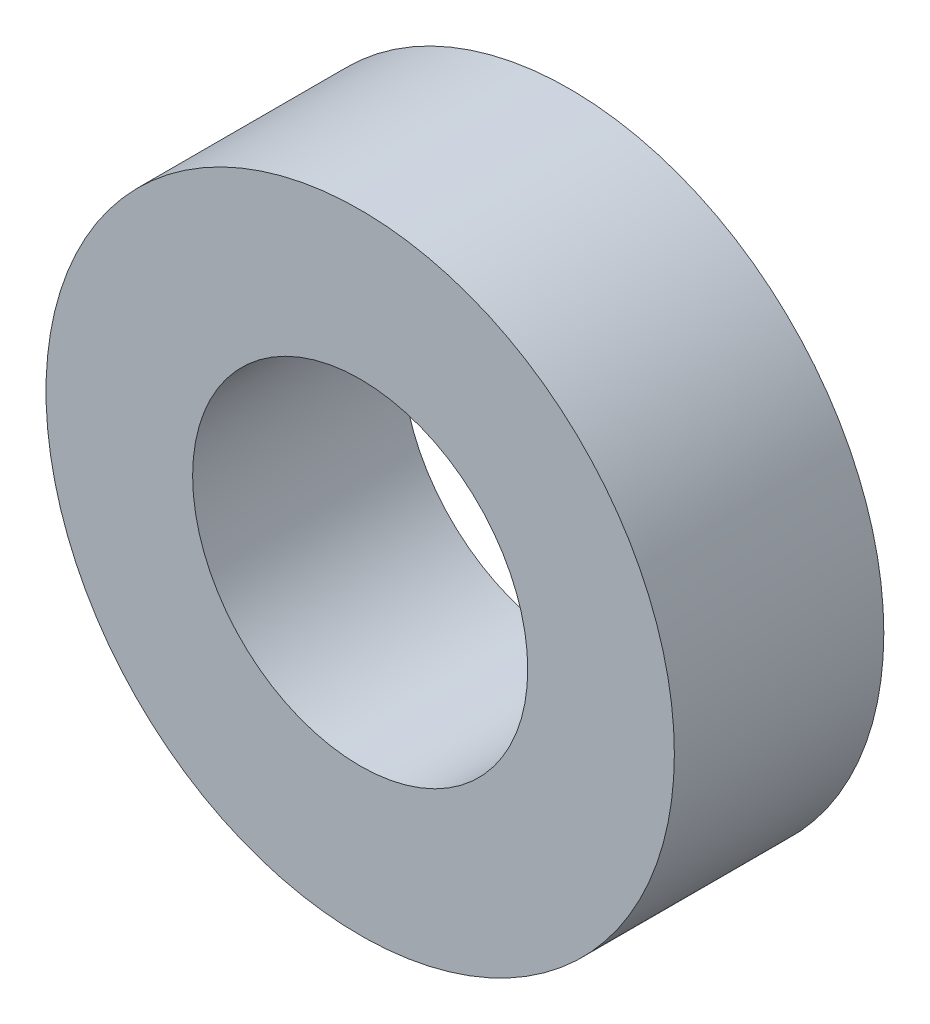
ISO-10303-21;
HEADER;
FILE_DESCRIPTION(('STEP AP214'),'2;1');
FILE_NAME('part.step','',(''),(''),'','','');
FILE_SCHEMA(('AUTOMOTIVE_DESIGN { 1 0 10303 214 1 1 1 1 }'));
ENDSEC;
DATA;
#1=APPLICATION_CONTEXT('core data for automotive mechanical design processes');
#2=APPLICATION_PROTOCOL_DEFINITION('international standard','automotive_design',2000,#1);
#3=PRODUCT_CONTEXT('',#1,'mechanical');
#4=PRODUCT('Part','Part','',(#3));
#5=PRODUCT_RELATED_PRODUCT_CATEGORY('part','',(#4));
#6=PRODUCT_DEFINITION_FORMATION('','',#4);
#7=PRODUCT_DEFINITION_CONTEXT('part definition',#1,'design');
#8=PRODUCT_DEFINITION('design','',#6,#7);
#9=PRODUCT_DEFINITION_SHAPE('','',#8);
#10=(LENGTH_UNIT() NAMED_UNIT(*) SI_UNIT(.MILLI.,.METRE.));
#11=(NAMED_UNIT(*) PLANE_ANGLE_UNIT() SI_UNIT($,.RADIAN.));
#12=(NAMED_UNIT(*) SI_UNIT($,.STERADIAN.) SOLID_ANGLE_UNIT());
#13=UNCERTAINTY_MEASURE_WITH_UNIT(LENGTH_MEASURE(1.E-05),#10,'distance_accuracy_value','');
#14=(GEOMETRIC_REPRESENTATION_CONTEXT(3) GLOBAL_UNCERTAINTY_ASSIGNED_CONTEXT((#13)) GLOBAL_UNIT_ASSIGNED_CONTEXT((#10,
#11,#12)) REPRESENTATION_CONTEXT('',''));
#15=CARTESIAN_POINT('',(0.,0.,0.));
#16=DIRECTION('',(0.,0.,1.));
#17=DIRECTION('',(1.,0.,0.));
#18=AXIS2_PLACEMENT_3D('',#15,#16,#17);
#19=CARTESIAN_POINT('',(0.,0.,0.999999999999999));
#20=DIRECTION('',(0.,0.,1.));
#21=DIRECTION('',(1.,0.,0.));
#22=AXIS2_PLACEMENT_3D('',#19,#20,#21);
#23=PLANE('',#22);
#24=CARTESIAN_POINT('',(0.,0.,0.999999999999999));
#25=DIRECTION('',(0.,0.,1.));
#26=DIRECTION('',(1.,0.,0.));
#27=AXIS2_PLACEMENT_3D('',#24,#25,#26);
#28=CIRCLE('',#27,3.);
#29=CARTESIAN_POINT('',(3.,0.,0.999999999999999));
#30=VERTEX_POINT('',#29);
#31=EDGE_CURVE('E10',#30,#30,#28,.T.);
#32=ORIENTED_EDGE('',*,*,#31,.T.);
#33=EDGE_LOOP('',(#32));
#34=FACE_BOUND('',#33,.T.);
#35=CARTESIAN_POINT('',(0.,0.,0.999999999999999));
#36=DIRECTION('',(0.,0.,1.));
#37=DIRECTION('',(1.,0.,0.));
#38=AXIS2_PLACEMENT_3D('',#35,#36,#37);
#39=CIRCLE('',#38,1.6);
#40=CARTESIAN_POINT('',(1.6,0.,0.999999999999999));
#41=VERTEX_POINT('',#40);
#42=EDGE_CURVE('E35',#41,#41,#39,.T.);
#43=ORIENTED_EDGE('',*,*,#42,.F.);
#44=EDGE_LOOP('',(#43));
#45=FACE_BOUND('',#44,.T.);
#46=ADVANCED_FACE('F28',(#34,#45),#23,.T.);
#47=CARTESIAN_POINT('',(0.,0.,0.999999999999999));
#48=DIRECTION('',(0.,0.,-1.));
#49=DIRECTION('',(-1.,0.,0.));
#50=AXIS2_PLACEMENT_3D('',#47,#48,#49);
#51=CYLINDRICAL_SURFACE('',#50,3.);
#52=ORIENTED_EDGE('',*,*,#31,.F.);
#53=EDGE_LOOP('',(#52));
#54=FACE_BOUND('',#53,.T.);
#55=CARTESIAN_POINT('',(0.,0.,-0.999999999999999));
#56=DIRECTION('',(0.,0.,1.));
#57=DIRECTION('',(1.,0.,0.));
#58=AXIS2_PLACEMENT_3D('',#55,#56,#57);
#59=CIRCLE('',#58,3.);
#60=CARTESIAN_POINT('',(3.,0.,-0.999999999999999));
#61=VERTEX_POINT('',#60);
#62=EDGE_CURVE('E39',#61,#61,#59,.T.);
#63=ORIENTED_EDGE('',*,*,#62,.T.);
#64=EDGE_LOOP('',(#63));
#65=FACE_BOUND('',#64,.T.);
#66=ADVANCED_FACE('F30',(#54,#65),#51,.T.);
#67=CARTESIAN_POINT('',(0.,0.,0.999999999999999));
#68=DIRECTION('',(0.,0.,-1.));
#69=DIRECTION('',(-1.,0.,0.));
#70=AXIS2_PLACEMENT_3D('',#67,#68,#69);
#71=CYLINDRICAL_SURFACE('',#70,1.6);
#72=ORIENTED_EDGE('',*,*,#42,.T.);
#73=EDGE_LOOP('',(#72));
#74=FACE_BOUND('',#73,.T.);
#75=CARTESIAN_POINT('',(0.,0.,-0.999999999999999));
#76=DIRECTION('',(0.,0.,1.));
#77=DIRECTION('',(1.,0.,0.));
#78=AXIS2_PLACEMENT_3D('',#75,#76,#77);
#79=CIRCLE('',#78,1.6);
#80=CARTESIAN_POINT('',(1.6,0.,-0.999999999999999));
#81=VERTEX_POINT('',#80);
#82=EDGE_CURVE('E43',#81,#81,#79,.T.);
#83=ORIENTED_EDGE('',*,*,#82,.F.);
#84=EDGE_LOOP('',(#83));
#85=FACE_BOUND('',#84,.T.);
#86=ADVANCED_FACE('F52',(#74,#85),#71,.F.);
#87=CARTESIAN_POINT('',(0.,0.,-0.999999999999999));
#88=DIRECTION('',(0.,0.,1.));
#89=DIRECTION('',(1.,0.,0.));
#90=AXIS2_PLACEMENT_3D('',#87,#88,#89);
#91=PLANE('',#90);
#92=ORIENTED_EDGE('',*,*,#82,.T.);
#93=EDGE_LOOP('',(#92));
#94=FACE_BOUND('',#93,.T.);
#95=ORIENTED_EDGE('',*,*,#62,.F.);
#96=EDGE_LOOP('',(#95));
#97=FACE_BOUND('',#96,.T.);
#98=ADVANCED_FACE('F49',(#94,#97),#91,.F.);
#99=CLOSED_SHELL('',(#46,#66,#86,#98));
#100=MANIFOLD_SOLID_BREP('B2',#99);
#101=ADVANCED_BREP_SHAPE_REPRESENTATION('',(#18,#100),#14);
#102=SHAPE_DEFINITION_REPRESENTATION(#9,#101);
ENDSEC;
END-ISO-10303-21;
